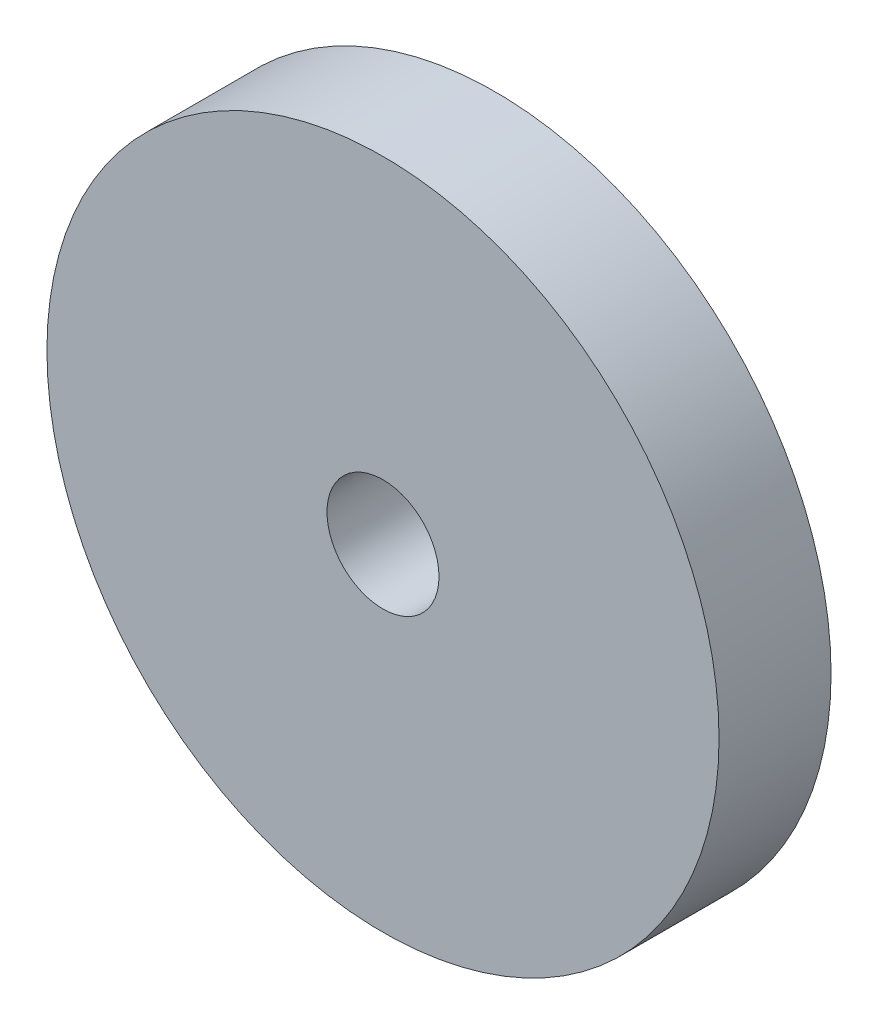
ISO-10303-21;
HEADER;
FILE_DESCRIPTION(('STEP AP214'),'2;1');
FILE_NAME('part.step','',(''),(''),'','','');
FILE_SCHEMA(('AUTOMOTIVE_DESIGN { 1 0 10303 214 1 1 1 1 }'));
ENDSEC;
DATA;
#1=APPLICATION_CONTEXT('core data for automotive mechanical design processes');
#2=APPLICATION_PROTOCOL_DEFINITION('international standard','automotive_design',2000,#1);
#3=PRODUCT_CONTEXT('',#1,'mechanical');
#4=PRODUCT('Part','Part','',(#3));
#5=PRODUCT_RELATED_PRODUCT_CATEGORY('part','',(#4));
#6=PRODUCT_DEFINITION_FORMATION('','',#4);
#7=PRODUCT_DEFINITION_CONTEXT('part definition',#1,'design');
#8=PRODUCT_DEFINITION('design','',#6,#7);
#9=PRODUCT_DEFINITION_SHAPE('','',#8);
#10=(LENGTH_UNIT() NAMED_UNIT(*) SI_UNIT(.MILLI.,.METRE.));
#11=(NAMED_UNIT(*) PLANE_ANGLE_UNIT() SI_UNIT($,.RADIAN.));
#12=(NAMED_UNIT(*) SI_UNIT($,.STERADIAN.) SOLID_ANGLE_UNIT());
#13=UNCERTAINTY_MEASURE_WITH_UNIT(LENGTH_MEASURE(1.E-05),#10,'distance_accuracy_value','');
#14=(GEOMETRIC_REPRESENTATION_CONTEXT(3) GLOBAL_UNCERTAINTY_ASSIGNED_CONTEXT((#13)) GLOBAL_UNIT_ASSIGNED_CONTEXT((#10,
#11,#12)) REPRESENTATION_CONTEXT('',''));
#15=CARTESIAN_POINT('',(0.,0.,0.));
#16=DIRECTION('',(0.,0.,1.));
#17=DIRECTION('',(1.,0.,0.));
#18=AXIS2_PLACEMENT_3D('',#15,#16,#17);
#19=CARTESIAN_POINT('',(0.,0.,20.));
#20=DIRECTION('',(0.,0.,1.));
#21=DIRECTION('',(1.,0.,0.));
#22=AXIS2_PLACEMENT_3D('',#19,#20,#21);
#23=PLANE('',#22);
#24=CARTESIAN_POINT('',(0.,0.,20.));
#25=DIRECTION('',(0.,0.,1.));
#26=DIRECTION('',(1.,0.,0.));
#27=AXIS2_PLACEMENT_3D('',#24,#25,#26);
#28=CIRCLE('',#27,10.);
#29=CARTESIAN_POINT('',(10.,0.,20.));
#30=VERTEX_POINT('',#29);
#31=EDGE_CURVE('E27',#30,#30,#28,.F.);
#32=ORIENTED_EDGE('',*,*,#31,.T.);
#33=EDGE_LOOP('',(#32));
#34=FACE_BOUND('',#33,.T.);
#35=CARTESIAN_POINT('',(0.,0.,20.));
#36=DIRECTION('',(0.,0.,1.));
#37=DIRECTION('',(1.,0.,0.));
#38=AXIS2_PLACEMENT_3D('',#35,#36,#37);
#39=CIRCLE('',#38,60.);
#40=CARTESIAN_POINT('',(60.,0.,20.));
#41=VERTEX_POINT('',#40);
#42=EDGE_CURVE('E18',#41,#41,#39,.F.);
#43=ORIENTED_EDGE('',*,*,#42,.F.);
#44=EDGE_LOOP('',(#43));
#45=FACE_BOUND('',#44,.T.);
#46=ADVANCED_FACE('F15',(#34,#45),#23,.T.);
#47=CARTESIAN_POINT('',(0.,0.,10.));
#48=DIRECTION('',(0.,0.,1.));
#49=DIRECTION('',(1.,0.,0.));
#50=AXIS2_PLACEMENT_3D('',#47,#48,#49);
#51=CYLINDRICAL_SURFACE('',#50,60.);
#52=CARTESIAN_POINT('',(0.,0.,0.));
#53=DIRECTION('',(0.,0.,1.));
#54=DIRECTION('',(1.,0.,0.));
#55=AXIS2_PLACEMENT_3D('',#52,#53,#54);
#56=CIRCLE('',#55,60.);
#57=CARTESIAN_POINT('',(60.,0.,0.));
#58=VERTEX_POINT('',#57);
#59=EDGE_CURVE('E22',#58,#58,#56,.T.);
#60=ORIENTED_EDGE('',*,*,#59,.T.);
#61=EDGE_LOOP('',(#60));
#62=FACE_BOUND('',#61,.T.);
#63=ORIENTED_EDGE('',*,*,#42,.T.);
#64=EDGE_LOOP('',(#63));
#65=FACE_BOUND('',#64,.T.);
#66=ADVANCED_FACE('F35',(#62,#65),#51,.T.);
#67=CARTESIAN_POINT('',(0.,0.,10.));
#68=DIRECTION('',(0.,0.,1.));
#69=DIRECTION('',(1.,0.,0.));
#70=AXIS2_PLACEMENT_3D('',#67,#68,#69);
#71=CYLINDRICAL_SURFACE('',#70,10.);
#72=CARTESIAN_POINT('',(0.,0.,0.));
#73=DIRECTION('',(0.,0.,1.));
#74=DIRECTION('',(1.,0.,0.));
#75=AXIS2_PLACEMENT_3D('',#72,#73,#74);
#76=CIRCLE('',#75,10.);
#77=CARTESIAN_POINT('',(10.,0.,0.));
#78=VERTEX_POINT('',#77);
#79=EDGE_CURVE('E10',#78,#78,#76,.F.);
#80=ORIENTED_EDGE('',*,*,#79,.T.);
#81=EDGE_LOOP('',(#80));
#82=FACE_BOUND('',#81,.T.);
#83=ORIENTED_EDGE('',*,*,#31,.F.);
#84=EDGE_LOOP('',(#83));
#85=FACE_BOUND('',#84,.T.);
#86=ADVANCED_FACE('F42',(#82,#85),#71,.F.);
#87=CARTESIAN_POINT('',(0.,0.,0.));
#88=DIRECTION('',(0.,0.,1.));
#89=DIRECTION('',(1.,0.,0.));
#90=AXIS2_PLACEMENT_3D('',#87,#88,#89);
#91=PLANE('',#90);
#92=ORIENTED_EDGE('',*,*,#79,.F.);
#93=EDGE_LOOP('',(#92));
#94=FACE_BOUND('',#93,.T.);
#95=ORIENTED_EDGE('',*,*,#59,.F.);
#96=EDGE_LOOP('',(#95));
#97=FACE_BOUND('',#96,.T.);
#98=ADVANCED_FACE('F44',(#94,#97),#91,.F.);
#99=CLOSED_SHELL('',(#46,#66,#86,#98));
#100=MANIFOLD_SOLID_BREP('B1',#99);
#101=ADVANCED_BREP_SHAPE_REPRESENTATION('',(#18,#100),#14);
#102=SHAPE_DEFINITION_REPRESENTATION(#9,#101);
ENDSEC;
END-ISO-10303-21;
